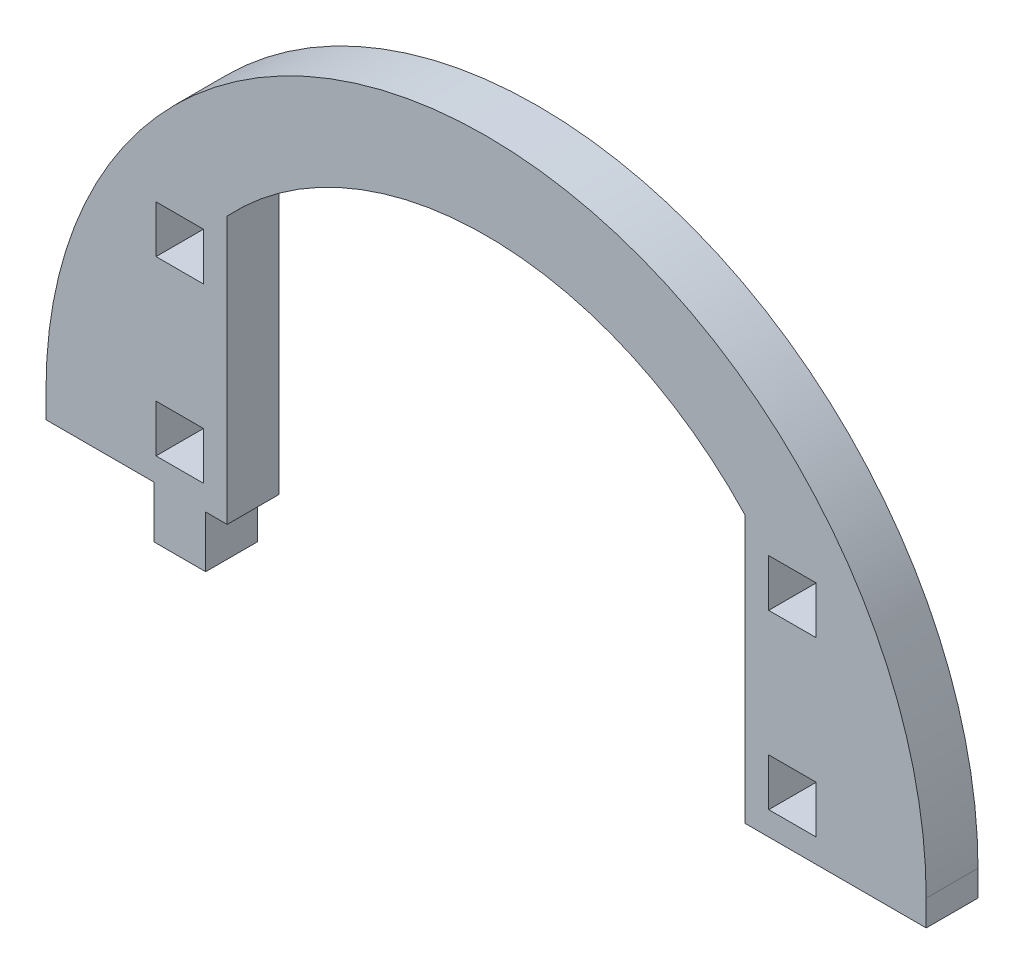
ISO-10303-21;
HEADER;
FILE_DESCRIPTION(('STEP AP214'),'2;1');
FILE_NAME('part.step','',(''),(''),'','','');
FILE_SCHEMA(('AUTOMOTIVE_DESIGN { 1 0 10303 214 1 1 1 1 }'));
ENDSEC;
DATA;
#1=APPLICATION_CONTEXT('core data for automotive mechanical design processes');
#2=APPLICATION_PROTOCOL_DEFINITION('international standard','automotive_design',2000,#1);
#3=PRODUCT_CONTEXT('',#1,'mechanical');
#4=PRODUCT('Part','Part','',(#3));
#5=PRODUCT_RELATED_PRODUCT_CATEGORY('part','',(#4));
#6=PRODUCT_DEFINITION_FORMATION('','',#4);
#7=PRODUCT_DEFINITION_CONTEXT('part definition',#1,'design');
#8=PRODUCT_DEFINITION('design','',#6,#7);
#9=PRODUCT_DEFINITION_SHAPE('','',#8);
#10=(LENGTH_UNIT() NAMED_UNIT(*) SI_UNIT(.MILLI.,.METRE.));
#11=(NAMED_UNIT(*) PLANE_ANGLE_UNIT() SI_UNIT($,.RADIAN.));
#12=(NAMED_UNIT(*) SI_UNIT($,.STERADIAN.) SOLID_ANGLE_UNIT());
#13=UNCERTAINTY_MEASURE_WITH_UNIT(LENGTH_MEASURE(1.E-05),#10,'distance_accuracy_value','');
#14=(GEOMETRIC_REPRESENTATION_CONTEXT(3) GLOBAL_UNCERTAINTY_ASSIGNED_CONTEXT((#13)) GLOBAL_UNIT_ASSIGNED_CONTEXT((#10,
#11,#12)) REPRESENTATION_CONTEXT('',''));
#15=CARTESIAN_POINT('',(0.,0.,0.));
#16=DIRECTION('',(0.,0.,1.));
#17=DIRECTION('',(1.,0.,0.));
#18=AXIS2_PLACEMENT_3D('',#15,#16,#17);
#19=CARTESIAN_POINT('',(3372.52554058257,1259.87734969929,6.));
#20=DIRECTION('',(0.,0.,1.));
#21=DIRECTION('',(1.,0.,0.));
#22=AXIS2_PLACEMENT_3D('',#19,#20,#21);
#23=PLANE('',#22);
#24=DIRECTION('',(0.,-1.,0.));
#25=VECTOR('',#24,1.);
#26=CARTESIAN_POINT('',(3423.52554058257,1259.87734969929,6.));
#27=LINE('',#26,#25);
#28=CARTESIAN_POINT('',(3423.52554058257,1259.87734969929,6.));
#29=VERTEX_POINT('',#28);
#30=CARTESIAN_POINT('',(3423.52554058257,1256.87734969929,6.));
#31=VERTEX_POINT('',#30);
#32=EDGE_CURVE('E607',#29,#31,#27,.T.);
#33=ORIENTED_EDGE('',*,*,#32,.F.);
#34=CARTESIAN_POINT('',(3372.52554058257,1259.87734969929,6.));
#35=DIRECTION('',(0.,0.,1.));
#36=DIRECTION('',(1.,0.,0.));
#37=AXIS2_PLACEMENT_3D('',#34,#35,#36);
#38=CIRCLE('',#37,50.9999999999999);
#39=CARTESIAN_POINT('',(3321.52554058257,1259.87734969929,6.));
#40=VERTEX_POINT('',#39);
#41=EDGE_CURVE('E645',#29,#40,#38,.T.);
#42=ORIENTED_EDGE('',*,*,#41,.T.);
#43=DIRECTION('',(0.,-1.,0.));
#44=VECTOR('',#43,1.);
#45=CARTESIAN_POINT('',(3321.52554058257,1259.87734969929,6.));
#46=LINE('',#45,#44);
#47=CARTESIAN_POINT('',(3321.52554058257,1256.87734969929,6.));
#48=VERTEX_POINT('',#47);
#49=EDGE_CURVE('E642',#40,#48,#46,.T.);
#50=ORIENTED_EDGE('',*,*,#49,.T.);
#51=DIRECTION('',(1.,0.,0.));
#52=VECTOR('',#51,1.);
#53=CARTESIAN_POINT('',(3321.52554058257,1256.87734969929,6.));
#54=LINE('',#53,#52);
#55=CARTESIAN_POINT('',(3334.02554058257,1256.87734969929,6.));
#56=VERTEX_POINT('',#55);
#57=EDGE_CURVE('E639',#48,#56,#54,.T.);
#58=ORIENTED_EDGE('',*,*,#57,.T.);
#59=DIRECTION('',(0.,-1.,0.));
#60=VECTOR('',#59,1.);
#61=CARTESIAN_POINT('',(3334.02554058257,1256.87734969929,6.));
#62=LINE('',#61,#60);
#63=CARTESIAN_POINT('',(3334.02554058257,1250.87734969929,6.));
#64=VERTEX_POINT('',#63);
#65=EDGE_CURVE('E636',#56,#64,#62,.T.);
#66=ORIENTED_EDGE('',*,*,#65,.T.);
#67=DIRECTION('',(1.,0.,0.));
#68=VECTOR('',#67,1.);
#69=CARTESIAN_POINT('',(3334.02554058257,1250.87734969929,6.));
#70=LINE('',#69,#68);
#71=CARTESIAN_POINT('',(3340.02554058257,1250.87734969929,6.));
#72=VERTEX_POINT('',#71);
#73=EDGE_CURVE('E633',#64,#72,#70,.T.);
#74=ORIENTED_EDGE('',*,*,#73,.T.);
#75=DIRECTION('',(0.,1.,0.));
#76=VECTOR('',#75,1.);
#77=CARTESIAN_POINT('',(3340.02554058257,1250.87734969929,6.));
#78=LINE('',#77,#76);
#79=CARTESIAN_POINT('',(3340.02554058257,1256.87734969929,6.));
#80=VERTEX_POINT('',#79);
#81=EDGE_CURVE('E630',#72,#80,#78,.T.);
#82=ORIENTED_EDGE('',*,*,#81,.T.);
#83=DIRECTION('',(1.,0.,0.));
#84=VECTOR('',#83,1.);
#85=CARTESIAN_POINT('',(3340.02554058257,1256.87734969929,6.));
#86=LINE('',#85,#84);
#87=CARTESIAN_POINT('',(3342.52554058257,1256.87734969929,6.));
#88=VERTEX_POINT('',#87);
#89=EDGE_CURVE('E627',#80,#88,#86,.T.);
#90=ORIENTED_EDGE('',*,*,#89,.T.);
#91=DIRECTION('',(0.,-1.,0.));
#92=VECTOR('',#91,1.);
#93=CARTESIAN_POINT('',(3342.52554058257,1287.82372692425,6.));
#94=LINE('',#93,#92);
#95=CARTESIAN_POINT('',(3342.52554058257,1287.82372692425,6.));
#96=VERTEX_POINT('',#95);
#97=EDGE_CURVE('E623',#96,#88,#94,.T.);
#98=ORIENTED_EDGE('',*,*,#97,.F.);
#99=CARTESIAN_POINT('',(3372.52554058257,1259.87734969929,6.));
#100=DIRECTION('',(0.,0.,1.));
#101=DIRECTION('',(1.,0.,0.));
#102=AXIS2_PLACEMENT_3D('',#99,#100,#101);
#103=CIRCLE('',#102,41.);
#104=CARTESIAN_POINT('',(3402.52554058257,1287.82372692425,6.));
#105=VERTEX_POINT('',#104);
#106=EDGE_CURVE('E619',#105,#96,#103,.T.);
#107=ORIENTED_EDGE('',*,*,#106,.F.);
#108=DIRECTION('',(0.,-1.,0.));
#109=VECTOR('',#108,1.);
#110=CARTESIAN_POINT('',(3402.52554058257,1287.82372692425,6.));
#111=LINE('',#110,#109);
#112=CARTESIAN_POINT('',(3402.52554058257,1256.87734969929,6.));
#113=VERTEX_POINT('',#112);
#114=EDGE_CURVE('E615',#105,#113,#111,.T.);
#115=ORIENTED_EDGE('',*,*,#114,.T.);
#116=DIRECTION('',(1.,0.,0.));
#117=VECTOR('',#116,1.);
#118=CARTESIAN_POINT('',(3413.52554058257,1256.87734969929,6.));
#119=LINE('',#118,#117);
#120=EDGE_CURVE('E611',#113,#31,#119,.T.);
#121=ORIENTED_EDGE('',*,*,#120,.T.);
#122=EDGE_LOOP('',(#33,#42,#50,#58,#66,#74,#82,#90,#98,#107,#115,#121));
#123=FACE_BOUND('',#122,.T.);
#124=DIRECTION('',(0.,1.,0.));
#125=VECTOR('',#124,1.);
#126=CARTESIAN_POINT('',(3339.77554058257,0.,6.));
#127=LINE('',#126,#125);
#128=CARTESIAN_POINT('',(3339.77554058257,1279.62734969929,6.));
#129=VERTEX_POINT('',#128);
#130=CARTESIAN_POINT('',(3339.77554058257,1285.12734969929,6.));
#131=VERTEX_POINT('',#130);
#132=EDGE_CURVE('E567',#129,#131,#127,.T.);
#133=ORIENTED_EDGE('',*,*,#132,.F.);
#134=DIRECTION('',(1.,0.,0.));
#135=VECTOR('',#134,1.);
#136=CARTESIAN_POINT('',(0.,1279.62734969929,6.));
#137=LINE('',#136,#135);
#138=CARTESIAN_POINT('',(3334.27554058257,1279.62734969929,6.));
#139=VERTEX_POINT('',#138);
#140=EDGE_CURVE('E564',#139,#129,#137,.T.);
#141=ORIENTED_EDGE('',*,*,#140,.F.);
#142=DIRECTION('',(0.,-1.,0.));
#143=VECTOR('',#142,1.);
#144=CARTESIAN_POINT('',(3334.27554058257,0.,6.));
#145=LINE('',#144,#143);
#146=CARTESIAN_POINT('',(3334.27554058257,1285.12734969929,6.));
#147=VERTEX_POINT('',#146);
#148=EDGE_CURVE('E575',#147,#139,#145,.T.);
#149=ORIENTED_EDGE('',*,*,#148,.F.);
#150=DIRECTION('',(-1.,0.,0.));
#151=VECTOR('',#150,1.);
#152=CARTESIAN_POINT('',(0.,1285.12734969929,6.));
#153=LINE('',#152,#151);
#154=EDGE_CURVE('E571',#131,#147,#153,.T.);
#155=ORIENTED_EDGE('',*,*,#154,.F.);
#156=EDGE_LOOP('',(#133,#141,#149,#155));
#157=FACE_BOUND('',#156,.T.);
#158=DIRECTION('',(0.,1.,0.));
#159=VECTOR('',#158,1.);
#160=CARTESIAN_POINT('',(3339.77554058257,0.,6.));
#161=LINE('',#160,#159);
#162=CARTESIAN_POINT('',(3339.77554058257,1259.62734969929,6.));
#163=VERTEX_POINT('',#162);
#164=CARTESIAN_POINT('',(3339.77554058257,1265.12734969929,6.));
#165=VERTEX_POINT('',#164);
#166=EDGE_CURVE('E524',#163,#165,#161,.T.);
#167=ORIENTED_EDGE('',*,*,#166,.F.);
#168=DIRECTION('',(1.,0.,0.));
#169=VECTOR('',#168,1.);
#170=CARTESIAN_POINT('',(0.,1259.62734969929,6.));
#171=LINE('',#170,#169);
#172=CARTESIAN_POINT('',(3334.27554058257,1259.62734969929,6.));
#173=VERTEX_POINT('',#172);
#174=EDGE_CURVE('E521',#173,#163,#171,.T.);
#175=ORIENTED_EDGE('',*,*,#174,.F.);
#176=DIRECTION('',(0.,-1.,0.));
#177=VECTOR('',#176,1.);
#178=CARTESIAN_POINT('',(3334.27554058257,0.,6.));
#179=LINE('',#178,#177);
#180=CARTESIAN_POINT('',(3334.27554058257,1265.12734969929,6.));
#181=VERTEX_POINT('',#180);
#182=EDGE_CURVE('E532',#181,#173,#179,.T.);
#183=ORIENTED_EDGE('',*,*,#182,.F.);
#184=DIRECTION('',(-1.,0.,0.));
#185=VECTOR('',#184,1.);
#186=CARTESIAN_POINT('',(0.,1265.12734969929,6.));
#187=LINE('',#186,#185);
#188=EDGE_CURVE('E528',#165,#181,#187,.T.);
#189=ORIENTED_EDGE('',*,*,#188,.F.);
#190=EDGE_LOOP('',(#167,#175,#183,#189));
#191=FACE_BOUND('',#190,.T.);
#192=DIRECTION('',(0.,1.,0.));
#193=VECTOR('',#192,1.);
#194=CARTESIAN_POINT('',(3410.77554058257,0.,6.));
#195=LINE('',#194,#193);
#196=CARTESIAN_POINT('',(3410.77554058257,1279.62734969929,6.));
#197=VERTEX_POINT('',#196);
#198=CARTESIAN_POINT('',(3410.77554058257,1285.12734969929,6.));
#199=VERTEX_POINT('',#198);
#200=EDGE_CURVE('E481',#197,#199,#195,.T.);
#201=ORIENTED_EDGE('',*,*,#200,.F.);
#202=DIRECTION('',(1.,0.,0.));
#203=VECTOR('',#202,1.);
#204=CARTESIAN_POINT('',(0.,1279.62734969929,6.));
#205=LINE('',#204,#203);
#206=CARTESIAN_POINT('',(3405.27554058257,1279.62734969929,6.));
#207=VERTEX_POINT('',#206);
#208=EDGE_CURVE('E478',#207,#197,#205,.T.);
#209=ORIENTED_EDGE('',*,*,#208,.F.);
#210=DIRECTION('',(0.,-1.,0.));
#211=VECTOR('',#210,1.);
#212=CARTESIAN_POINT('',(3405.27554058257,0.,6.));
#213=LINE('',#212,#211);
#214=CARTESIAN_POINT('',(3405.27554058257,1285.12734969929,6.));
#215=VERTEX_POINT('',#214);
#216=EDGE_CURVE('E489',#215,#207,#213,.T.);
#217=ORIENTED_EDGE('',*,*,#216,.F.);
#218=DIRECTION('',(-1.,0.,0.));
#219=VECTOR('',#218,1.);
#220=CARTESIAN_POINT('',(0.,1285.12734969929,6.));
#221=LINE('',#220,#219);
#222=EDGE_CURVE('E485',#199,#215,#221,.T.);
#223=ORIENTED_EDGE('',*,*,#222,.F.);
#224=EDGE_LOOP('',(#201,#209,#217,#223));
#225=FACE_BOUND('',#224,.T.);
#226=DIRECTION('',(0.,1.,0.));
#227=VECTOR('',#226,1.);
#228=CARTESIAN_POINT('',(3410.77554058257,0.,6.));
#229=LINE('',#228,#227);
#230=CARTESIAN_POINT('',(3410.77554058257,1259.62734969929,6.));
#231=VERTEX_POINT('',#230);
#232=CARTESIAN_POINT('',(3410.77554058257,1265.12734969929,6.));
#233=VERTEX_POINT('',#232);
#234=EDGE_CURVE('E439',#231,#233,#229,.T.);
#235=ORIENTED_EDGE('',*,*,#234,.F.);
#236=DIRECTION('',(1.,0.,0.));
#237=VECTOR('',#236,1.);
#238=CARTESIAN_POINT('',(0.,1259.62734969929,6.));
#239=LINE('',#238,#237);
#240=CARTESIAN_POINT('',(3405.27554058257,1259.62734969929,6.));
#241=VERTEX_POINT('',#240);
#242=EDGE_CURVE('E430',#241,#231,#239,.T.);
#243=ORIENTED_EDGE('',*,*,#242,.F.);
#244=DIRECTION('',(0.,-1.,0.));
#245=VECTOR('',#244,1.);
#246=CARTESIAN_POINT('',(3405.27554058257,0.,6.));
#247=LINE('',#246,#245);
#248=CARTESIAN_POINT('',(3405.27554058257,1265.12734969929,6.));
#249=VERTEX_POINT('',#248);
#250=EDGE_CURVE('E456',#249,#241,#247,.T.);
#251=ORIENTED_EDGE('',*,*,#250,.F.);
#252=DIRECTION('',(-1.,0.,0.));
#253=VECTOR('',#252,1.);
#254=CARTESIAN_POINT('',(0.,1265.12734969929,6.));
#255=LINE('',#254,#253);
#256=EDGE_CURVE('E452',#233,#249,#255,.T.);
#257=ORIENTED_EDGE('',*,*,#256,.F.);
#258=EDGE_LOOP('',(#235,#243,#251,#257));
#259=FACE_BOUND('',#258,.T.);
#260=ADVANCED_FACE('F243',(#123,#157,#191,#225,#259),#23,.T.);
#261=CARTESIAN_POINT('',(3372.52554058257,1259.87734969929,0.));
#262=DIRECTION('',(0.,0.,1.));
#263=DIRECTION('',(1.,0.,0.));
#264=AXIS2_PLACEMENT_3D('',#261,#262,#263);
#265=PLANE('',#264);
#266=DIRECTION('',(1.,0.,0.));
#267=VECTOR('',#266,1.);
#268=CARTESIAN_POINT('',(0.,1279.62734969929,0.));
#269=LINE('',#268,#267);
#270=CARTESIAN_POINT('',(3405.27554058257,1279.62734969929,0.));
#271=VERTEX_POINT('',#270);
#272=CARTESIAN_POINT('',(3410.77554058257,1279.62734969929,0.));
#273=VERTEX_POINT('',#272);
#274=EDGE_CURVE('E448',#271,#273,#269,.T.);
#275=ORIENTED_EDGE('',*,*,#274,.T.);
#276=DIRECTION('',(0.,1.,0.));
#277=VECTOR('',#276,1.);
#278=CARTESIAN_POINT('',(3410.77554058257,0.,0.));
#279=LINE('',#278,#277);
#280=CARTESIAN_POINT('',(3410.77554058257,1285.12734969929,0.));
#281=VERTEX_POINT('',#280);
#282=EDGE_CURVE('E496',#273,#281,#279,.T.);
#283=ORIENTED_EDGE('',*,*,#282,.T.);
#284=DIRECTION('',(-1.,0.,0.));
#285=VECTOR('',#284,1.);
#286=CARTESIAN_POINT('',(0.,1285.12734969929,0.));
#287=LINE('',#286,#285);
#288=CARTESIAN_POINT('',(3405.27554058257,1285.12734969929,0.));
#289=VERTEX_POINT('',#288);
#290=EDGE_CURVE('E500',#281,#289,#287,.T.);
#291=ORIENTED_EDGE('',*,*,#290,.T.);
#292=DIRECTION('',(0.,-1.,0.));
#293=VECTOR('',#292,1.);
#294=CARTESIAN_POINT('',(3405.27554058257,0.,0.));
#295=LINE('',#294,#293);
#296=EDGE_CURVE('E482',#289,#271,#295,.T.);
#297=ORIENTED_EDGE('',*,*,#296,.T.);
#298=EDGE_LOOP('',(#275,#283,#291,#297));
#299=FACE_BOUND('',#298,.T.);
#300=DIRECTION('',(1.,0.,0.));
#301=VECTOR('',#300,1.);
#302=CARTESIAN_POINT('',(0.,1279.62734969929,0.));
#303=LINE('',#302,#301);
#304=CARTESIAN_POINT('',(3334.27554058257,1279.62734969929,0.));
#305=VERTEX_POINT('',#304);
#306=CARTESIAN_POINT('',(3339.77554058257,1279.62734969929,0.));
#307=VERTEX_POINT('',#306);
#308=EDGE_CURVE('E563',#305,#307,#303,.T.);
#309=ORIENTED_EDGE('',*,*,#308,.T.);
#310=DIRECTION('',(0.,1.,0.));
#311=VECTOR('',#310,1.);
#312=CARTESIAN_POINT('',(3339.77554058257,0.,0.));
#313=LINE('',#312,#311);
#314=CARTESIAN_POINT('',(3339.77554058257,1285.12734969929,0.));
#315=VERTEX_POINT('',#314);
#316=EDGE_CURVE('E582',#307,#315,#313,.T.);
#317=ORIENTED_EDGE('',*,*,#316,.T.);
#318=DIRECTION('',(-1.,0.,0.));
#319=VECTOR('',#318,1.);
#320=CARTESIAN_POINT('',(0.,1285.12734969929,0.));
#321=LINE('',#320,#319);
#322=CARTESIAN_POINT('',(3334.27554058257,1285.12734969929,0.));
#323=VERTEX_POINT('',#322);
#324=EDGE_CURVE('E586',#315,#323,#321,.T.);
#325=ORIENTED_EDGE('',*,*,#324,.T.);
#326=DIRECTION('',(0.,-1.,0.));
#327=VECTOR('',#326,1.);
#328=CARTESIAN_POINT('',(3334.27554058257,0.,0.));
#329=LINE('',#328,#327);
#330=EDGE_CURVE('E568',#323,#305,#329,.T.);
#331=ORIENTED_EDGE('',*,*,#330,.T.);
#332=EDGE_LOOP('',(#309,#317,#325,#331));
#333=FACE_BOUND('',#332,.T.);
#334=DIRECTION('',(0.,-1.,0.));
#335=VECTOR('',#334,1.);
#336=CARTESIAN_POINT('',(3423.52554058257,1259.87734969929,0.));
#337=LINE('',#336,#335);
#338=CARTESIAN_POINT('',(3423.52554058257,1259.87734969929,0.));
#339=VERTEX_POINT('',#338);
#340=CARTESIAN_POINT('',(3423.52554058257,1256.87734969929,0.));
#341=VERTEX_POINT('',#340);
#342=EDGE_CURVE('E606',#339,#341,#337,.T.);
#343=ORIENTED_EDGE('',*,*,#342,.T.);
#344=DIRECTION('',(1.,0.,0.));
#345=VECTOR('',#344,1.);
#346=CARTESIAN_POINT('',(3402.52554058257,1256.87734969929,0.));
#347=LINE('',#346,#345);
#348=CARTESIAN_POINT('',(3402.52554058257,1256.87734969929,0.));
#349=VERTEX_POINT('',#348);
#350=EDGE_CURVE('E651',#349,#341,#347,.T.);
#351=ORIENTED_EDGE('',*,*,#350,.F.);
#352=DIRECTION('',(0.,-1.,0.));
#353=VECTOR('',#352,1.);
#354=CARTESIAN_POINT('',(3402.52554058257,1287.82372692425,0.));
#355=LINE('',#354,#353);
#356=CARTESIAN_POINT('',(3402.52554058257,1287.82372692425,0.));
#357=VERTEX_POINT('',#356);
#358=EDGE_CURVE('E654',#357,#349,#355,.T.);
#359=ORIENTED_EDGE('',*,*,#358,.F.);
#360=CARTESIAN_POINT('',(3372.52554058257,1259.87734969929,0.));
#361=DIRECTION('',(0.,0.,1.));
#362=DIRECTION('',(1.,0.,0.));
#363=AXIS2_PLACEMENT_3D('',#360,#361,#362);
#364=CIRCLE('',#363,41.);
#365=CARTESIAN_POINT('',(3342.52554058257,1287.82372692425,0.));
#366=VERTEX_POINT('',#365);
#367=EDGE_CURVE('E657',#357,#366,#364,.T.);
#368=ORIENTED_EDGE('',*,*,#367,.T.);
#369=DIRECTION('',(0.,-1.,0.));
#370=VECTOR('',#369,1.);
#371=CARTESIAN_POINT('',(3342.52554058257,1287.82372692425,0.));
#372=LINE('',#371,#370);
#373=CARTESIAN_POINT('',(3342.52554058257,1256.87734969929,0.));
#374=VERTEX_POINT('',#373);
#375=EDGE_CURVE('E661',#366,#374,#372,.T.);
#376=ORIENTED_EDGE('',*,*,#375,.T.);
#377=DIRECTION('',(1.,0.,0.));
#378=VECTOR('',#377,1.);
#379=CARTESIAN_POINT('',(3340.02554058257,1256.87734969929,0.));
#380=LINE('',#379,#378);
#381=CARTESIAN_POINT('',(3340.02554058257,1256.87734969929,0.));
#382=VERTEX_POINT('',#381);
#383=EDGE_CURVE('E665',#382,#374,#380,.T.);
#384=ORIENTED_EDGE('',*,*,#383,.F.);
#385=DIRECTION('',(0.,1.,0.));
#386=VECTOR('',#385,1.);
#387=CARTESIAN_POINT('',(3340.02554058257,1250.87734969929,0.));
#388=LINE('',#387,#386);
#389=CARTESIAN_POINT('',(3340.02554058257,1250.87734969929,0.));
#390=VERTEX_POINT('',#389);
#391=EDGE_CURVE('E669',#390,#382,#388,.T.);
#392=ORIENTED_EDGE('',*,*,#391,.F.);
#393=DIRECTION('',(1.,0.,0.));
#394=VECTOR('',#393,1.);
#395=CARTESIAN_POINT('',(3334.02554058257,1250.87734969929,0.));
#396=LINE('',#395,#394);
#397=CARTESIAN_POINT('',(3334.02554058257,1250.87734969929,0.));
#398=VERTEX_POINT('',#397);
#399=EDGE_CURVE('E672',#398,#390,#396,.T.);
#400=ORIENTED_EDGE('',*,*,#399,.F.);
#401=DIRECTION('',(0.,-1.,0.));
#402=VECTOR('',#401,1.);
#403=CARTESIAN_POINT('',(3334.02554058257,1256.87734969929,0.));
#404=LINE('',#403,#402);
#405=CARTESIAN_POINT('',(3334.02554058257,1256.87734969929,0.));
#406=VERTEX_POINT('',#405);
#407=EDGE_CURVE('E675',#406,#398,#404,.T.);
#408=ORIENTED_EDGE('',*,*,#407,.F.);
#409=DIRECTION('',(1.,0.,0.));
#410=VECTOR('',#409,1.);
#411=CARTESIAN_POINT('',(3321.52554058257,1256.87734969929,0.));
#412=LINE('',#411,#410);
#413=CARTESIAN_POINT('',(3321.52554058257,1256.87734969929,0.));
#414=VERTEX_POINT('',#413);
#415=EDGE_CURVE('E678',#414,#406,#412,.T.);
#416=ORIENTED_EDGE('',*,*,#415,.F.);
#417=DIRECTION('',(0.,-1.,0.));
#418=VECTOR('',#417,1.);
#419=CARTESIAN_POINT('',(3321.52554058257,1259.87734969929,0.));
#420=LINE('',#419,#418);
#421=CARTESIAN_POINT('',(3321.52554058257,1259.87734969929,0.));
#422=VERTEX_POINT('',#421);
#423=EDGE_CURVE('E681',#422,#414,#420,.T.);
#424=ORIENTED_EDGE('',*,*,#423,.F.);
#425=CARTESIAN_POINT('',(3372.52554058257,1259.87734969929,0.));
#426=DIRECTION('',(0.,0.,1.));
#427=DIRECTION('',(1.,0.,0.));
#428=AXIS2_PLACEMENT_3D('',#425,#426,#427);
#429=CIRCLE('',#428,50.9999999999999);
#430=EDGE_CURVE('E612',#339,#422,#429,.T.);
#431=ORIENTED_EDGE('',*,*,#430,.F.);
#432=EDGE_LOOP('',(#343,#351,#359,#368,#376,#384,#392,#400,#408,#416,#424,#431));
#433=FACE_BOUND('',#432,.T.);
#434=DIRECTION('',(1.,0.,0.));
#435=VECTOR('',#434,1.);
#436=CARTESIAN_POINT('',(0.,1259.62734969929,0.));
#437=LINE('',#436,#435);
#438=CARTESIAN_POINT('',(3334.27554058257,1259.62734969929,0.));
#439=VERTEX_POINT('',#438);
#440=CARTESIAN_POINT('',(3339.77554058257,1259.62734969929,0.));
#441=VERTEX_POINT('',#440);
#442=EDGE_CURVE('E520',#439,#441,#437,.T.);
#443=ORIENTED_EDGE('',*,*,#442,.T.);
#444=DIRECTION('',(0.,1.,0.));
#445=VECTOR('',#444,1.);
#446=CARTESIAN_POINT('',(3339.77554058257,0.,0.));
#447=LINE('',#446,#445);
#448=CARTESIAN_POINT('',(3339.77554058257,1265.12734969929,0.));
#449=VERTEX_POINT('',#448);
#450=EDGE_CURVE('E539',#441,#449,#447,.T.);
#451=ORIENTED_EDGE('',*,*,#450,.T.);
#452=DIRECTION('',(-1.,0.,0.));
#453=VECTOR('',#452,1.);
#454=CARTESIAN_POINT('',(0.,1265.12734969929,0.));
#455=LINE('',#454,#453);
#456=CARTESIAN_POINT('',(3334.27554058257,1265.12734969929,0.));
#457=VERTEX_POINT('',#456);
#458=EDGE_CURVE('E543',#449,#457,#455,.T.);
#459=ORIENTED_EDGE('',*,*,#458,.T.);
#460=DIRECTION('',(0.,-1.,0.));
#461=VECTOR('',#460,1.);
#462=CARTESIAN_POINT('',(3334.27554058257,0.,0.));
#463=LINE('',#462,#461);
#464=EDGE_CURVE('E525',#457,#439,#463,.T.);
#465=ORIENTED_EDGE('',*,*,#464,.T.);
#466=EDGE_LOOP('',(#443,#451,#459,#465));
#467=FACE_BOUND('',#466,.T.);
#468=DIRECTION('',(1.,0.,0.));
#469=VECTOR('',#468,1.);
#470=CARTESIAN_POINT('',(0.,1259.62734969929,0.));
#471=LINE('',#470,#469);
#472=CARTESIAN_POINT('',(3405.27554058257,1259.62734969929,0.));
#473=VERTEX_POINT('',#472);
#474=CARTESIAN_POINT('',(3410.77554058257,1259.62734969929,0.));
#475=VERTEX_POINT('',#474);
#476=EDGE_CURVE('E269',#473,#475,#471,.T.);
#477=ORIENTED_EDGE('',*,*,#476,.T.);
#478=DIRECTION('',(0.,1.,0.));
#479=VECTOR('',#478,1.);
#480=CARTESIAN_POINT('',(3410.77554058257,0.,0.));
#481=LINE('',#480,#479);
#482=CARTESIAN_POINT('',(3410.77554058257,1265.12734969929,0.));
#483=VERTEX_POINT('',#482);
#484=EDGE_CURVE('E446',#475,#483,#481,.T.);
#485=ORIENTED_EDGE('',*,*,#484,.T.);
#486=DIRECTION('',(-1.,0.,0.));
#487=VECTOR('',#486,1.);
#488=CARTESIAN_POINT('',(0.,1265.12734969929,0.));
#489=LINE('',#488,#487);
#490=CARTESIAN_POINT('',(3405.27554058257,1265.12734969929,0.));
#491=VERTEX_POINT('',#490);
#492=EDGE_CURVE('E465',#483,#491,#489,.T.);
#493=ORIENTED_EDGE('',*,*,#492,.T.);
#494=DIRECTION('',(0.,-1.,0.));
#495=VECTOR('',#494,1.);
#496=CARTESIAN_POINT('',(3405.27554058257,0.,0.));
#497=LINE('',#496,#495);
#498=EDGE_CURVE('E440',#491,#473,#497,.T.);
#499=ORIENTED_EDGE('',*,*,#498,.T.);
#500=EDGE_LOOP('',(#477,#485,#493,#499));
#501=FACE_BOUND('',#500,.T.);
#502=ADVANCED_FACE('F731',(#299,#333,#433,#467,#501),#265,.F.);
#503=CARTESIAN_POINT('',(3423.52554058257,1259.87734969929,6.));
#504=DIRECTION('',(1.,0.,0.));
#505=DIRECTION('',(0.,0.,-1.));
#506=AXIS2_PLACEMENT_3D('',#503,#504,#505);
#507=PLANE('',#506);
#508=ORIENTED_EDGE('',*,*,#342,.F.);
#509=DIRECTION('',(0.,0.,-1.));
#510=VECTOR('',#509,1.);
#511=CARTESIAN_POINT('',(3423.52554058257,1259.87734969929,6.));
#512=LINE('',#511,#510);
#513=EDGE_CURVE('E12',#29,#339,#512,.T.);
#514=ORIENTED_EDGE('',*,*,#513,.F.);
#515=ORIENTED_EDGE('',*,*,#32,.T.);
#516=DIRECTION('',(0.,0.,-1.));
#517=VECTOR('',#516,1.);
#518=CARTESIAN_POINT('',(3423.52554058257,1256.87734969929,6.));
#519=LINE('',#518,#517);
#520=EDGE_CURVE('E247',#31,#341,#519,.T.);
#521=ORIENTED_EDGE('',*,*,#520,.T.);
#522=EDGE_LOOP('',(#508,#514,#515,#521));
#523=FACE_BOUND('',#522,.T.);
#524=ADVANCED_FACE('F245',(#523),#507,.T.);
#525=CARTESIAN_POINT('',(3372.52554058257,1259.87734969929,6.));
#526=DIRECTION('',(0.,0.,-1.));
#527=DIRECTION('',(-1.,0.,0.));
#528=AXIS2_PLACEMENT_3D('',#525,#526,#527);
#529=CYLINDRICAL_SURFACE('',#528,50.9999999999999);
#530=ORIENTED_EDGE('',*,*,#430,.T.);
#531=DIRECTION('',(0.,0.,-1.));
#532=VECTOR('',#531,1.);
#533=CARTESIAN_POINT('',(3321.52554058257,1259.87734969929,6.));
#534=LINE('',#533,#532);
#535=EDGE_CURVE('E253',#40,#422,#534,.T.);
#536=ORIENTED_EDGE('',*,*,#535,.F.);
#537=ORIENTED_EDGE('',*,*,#41,.F.);
#538=ORIENTED_EDGE('',*,*,#513,.T.);
#539=EDGE_LOOP('',(#530,#536,#537,#538));
#540=FACE_BOUND('',#539,.T.);
#541=ADVANCED_FACE('F738',(#540),#529,.T.);
#542=CARTESIAN_POINT('',(3321.52554058257,1259.87734969929,6.));
#543=DIRECTION('',(1.,0.,0.));
#544=DIRECTION('',(0.,0.,-1.));
#545=AXIS2_PLACEMENT_3D('',#542,#543,#544);
#546=PLANE('',#545);
#547=ORIENTED_EDGE('',*,*,#423,.T.);
#548=DIRECTION('',(0.,0.,-1.));
#549=VECTOR('',#548,1.);
#550=CARTESIAN_POINT('',(3321.52554058257,1256.87734969929,6.));
#551=LINE('',#550,#549);
#552=EDGE_CURVE('E689',#48,#414,#551,.T.);
#553=ORIENTED_EDGE('',*,*,#552,.F.);
#554=ORIENTED_EDGE('',*,*,#49,.F.);
#555=ORIENTED_EDGE('',*,*,#535,.T.);
#556=EDGE_LOOP('',(#547,#553,#554,#555));
#557=FACE_BOUND('',#556,.T.);
#558=ADVANCED_FACE('F742',(#557),#546,.F.);
#559=CARTESIAN_POINT('',(3321.52554058257,1256.87734969929,6.));
#560=DIRECTION('',(0.,1.,0.));
#561=DIRECTION('',(0.,0.,1.));
#562=AXIS2_PLACEMENT_3D('',#559,#560,#561);
#563=PLANE('',#562);
#564=ORIENTED_EDGE('',*,*,#415,.T.);
#565=DIRECTION('',(0.,0.,-1.));
#566=VECTOR('',#565,1.);
#567=CARTESIAN_POINT('',(3334.02554058257,1256.87734969929,6.));
#568=LINE('',#567,#566);
#569=EDGE_CURVE('E693',#56,#406,#568,.T.);
#570=ORIENTED_EDGE('',*,*,#569,.F.);
#571=ORIENTED_EDGE('',*,*,#57,.F.);
#572=ORIENTED_EDGE('',*,*,#552,.T.);
#573=EDGE_LOOP('',(#564,#570,#571,#572));
#574=FACE_BOUND('',#573,.T.);
#575=ADVANCED_FACE('F777',(#574),#563,.F.);
#576=CARTESIAN_POINT('',(3334.02554058257,1256.87734969929,6.));
#577=DIRECTION('',(1.,0.,0.));
#578=DIRECTION('',(0.,0.,-1.));
#579=AXIS2_PLACEMENT_3D('',#576,#577,#578);
#580=PLANE('',#579);
#581=ORIENTED_EDGE('',*,*,#407,.T.);
#582=DIRECTION('',(0.,0.,-1.));
#583=VECTOR('',#582,1.);
#584=CARTESIAN_POINT('',(3334.02554058257,1250.87734969929,6.));
#585=LINE('',#584,#583);
#586=EDGE_CURVE('E697',#64,#398,#585,.T.);
#587=ORIENTED_EDGE('',*,*,#586,.F.);
#588=ORIENTED_EDGE('',*,*,#65,.F.);
#589=ORIENTED_EDGE('',*,*,#569,.T.);
#590=EDGE_LOOP('',(#581,#587,#588,#589));
#591=FACE_BOUND('',#590,.T.);
#592=ADVANCED_FACE('F780',(#591),#580,.F.);
#593=CARTESIAN_POINT('',(3334.02554058257,1250.87734969929,6.));
#594=DIRECTION('',(0.,1.,0.));
#595=DIRECTION('',(0.,0.,1.));
#596=AXIS2_PLACEMENT_3D('',#593,#594,#595);
#597=PLANE('',#596);
#598=ORIENTED_EDGE('',*,*,#399,.T.);
#599=DIRECTION('',(0.,0.,-1.));
#600=VECTOR('',#599,1.);
#601=CARTESIAN_POINT('',(3340.02554058257,1250.87734969929,6.));
#602=LINE('',#601,#600);
#603=EDGE_CURVE('E701',#72,#390,#602,.T.);
#604=ORIENTED_EDGE('',*,*,#603,.F.);
#605=ORIENTED_EDGE('',*,*,#73,.F.);
#606=ORIENTED_EDGE('',*,*,#586,.T.);
#607=EDGE_LOOP('',(#598,#604,#605,#606));
#608=FACE_BOUND('',#607,.T.);
#609=ADVANCED_FACE('F784',(#608),#597,.F.);
#610=CARTESIAN_POINT('',(3340.02554058257,1250.87734969929,6.));
#611=DIRECTION('',(-1.,0.,0.));
#612=DIRECTION('',(0.,0.,1.));
#613=AXIS2_PLACEMENT_3D('',#610,#611,#612);
#614=PLANE('',#613);
#615=ORIENTED_EDGE('',*,*,#391,.T.);
#616=DIRECTION('',(0.,0.,-1.));
#617=VECTOR('',#616,1.);
#618=CARTESIAN_POINT('',(3340.02554058257,1256.87734969929,6.));
#619=LINE('',#618,#617);
#620=EDGE_CURVE('E705',#80,#382,#619,.T.);
#621=ORIENTED_EDGE('',*,*,#620,.F.);
#622=ORIENTED_EDGE('',*,*,#81,.F.);
#623=ORIENTED_EDGE('',*,*,#603,.T.);
#624=EDGE_LOOP('',(#615,#621,#622,#623));
#625=FACE_BOUND('',#624,.T.);
#626=ADVANCED_FACE('F788',(#625),#614,.F.);
#627=CARTESIAN_POINT('',(3340.02554058257,1256.87734969929,6.));
#628=DIRECTION('',(0.,1.,0.));
#629=DIRECTION('',(0.,0.,1.));
#630=AXIS2_PLACEMENT_3D('',#627,#628,#629);
#631=PLANE('',#630);
#632=ORIENTED_EDGE('',*,*,#383,.T.);
#633=DIRECTION('',(0.,0.,-1.));
#634=VECTOR('',#633,1.);
#635=CARTESIAN_POINT('',(3342.52554058257,1256.87734969929,6.));
#636=LINE('',#635,#634);
#637=EDGE_CURVE('E709',#88,#374,#636,.T.);
#638=ORIENTED_EDGE('',*,*,#637,.F.);
#639=ORIENTED_EDGE('',*,*,#89,.F.);
#640=ORIENTED_EDGE('',*,*,#620,.T.);
#641=EDGE_LOOP('',(#632,#638,#639,#640));
#642=FACE_BOUND('',#641,.T.);
#643=ADVANCED_FACE('F792',(#642),#631,.F.);
#644=CARTESIAN_POINT('',(3342.52554058257,1287.82372692425,6.));
#645=DIRECTION('',(1.,0.,0.));
#646=DIRECTION('',(0.,0.,-1.));
#647=AXIS2_PLACEMENT_3D('',#644,#645,#646);
#648=PLANE('',#647);
#649=ORIENTED_EDGE('',*,*,#375,.F.);
#650=DIRECTION('',(0.,0.,-1.));
#651=VECTOR('',#650,1.);
#652=CARTESIAN_POINT('',(3342.52554058257,1287.82372692425,6.));
#653=LINE('',#652,#651);
#654=EDGE_CURVE('E712',#96,#366,#653,.T.);
#655=ORIENTED_EDGE('',*,*,#654,.F.);
#656=ORIENTED_EDGE('',*,*,#97,.T.);
#657=ORIENTED_EDGE('',*,*,#637,.T.);
#658=EDGE_LOOP('',(#649,#655,#656,#657));
#659=FACE_BOUND('',#658,.T.);
#660=ADVANCED_FACE('F796',(#659),#648,.T.);
#661=CARTESIAN_POINT('',(3372.52554058257,1259.87734969929,6.));
#662=DIRECTION('',(0.,0.,-1.));
#663=DIRECTION('',(-1.,0.,0.));
#664=AXIS2_PLACEMENT_3D('',#661,#662,#663);
#665=CYLINDRICAL_SURFACE('',#664,41.);
#666=ORIENTED_EDGE('',*,*,#367,.F.);
#667=DIRECTION('',(0.,0.,-1.));
#668=VECTOR('',#667,1.);
#669=CARTESIAN_POINT('',(3402.52554058257,1287.82372692425,6.));
#670=LINE('',#669,#668);
#671=EDGE_CURVE('E715',#105,#357,#670,.T.);
#672=ORIENTED_EDGE('',*,*,#671,.F.);
#673=ORIENTED_EDGE('',*,*,#106,.T.);
#674=ORIENTED_EDGE('',*,*,#654,.T.);
#675=EDGE_LOOP('',(#666,#672,#673,#674));
#676=FACE_BOUND('',#675,.T.);
#677=ADVANCED_FACE('F761',(#676),#665,.F.);
#678=CARTESIAN_POINT('',(3402.52554058257,1287.82372692425,6.));
#679=DIRECTION('',(1.,0.,0.));
#680=DIRECTION('',(0.,0.,-1.));
#681=AXIS2_PLACEMENT_3D('',#678,#679,#680);
#682=PLANE('',#681);
#683=ORIENTED_EDGE('',*,*,#358,.T.);
#684=DIRECTION('',(0.,0.,-1.));
#685=VECTOR('',#684,1.);
#686=CARTESIAN_POINT('',(3402.52554058257,1256.87734969929,6.));
#687=LINE('',#686,#685);
#688=EDGE_CURVE('E717',#113,#349,#687,.T.);
#689=ORIENTED_EDGE('',*,*,#688,.F.);
#690=ORIENTED_EDGE('',*,*,#114,.F.);
#691=ORIENTED_EDGE('',*,*,#671,.T.);
#692=EDGE_LOOP('',(#683,#689,#690,#691));
#693=FACE_BOUND('',#692,.T.);
#694=ADVANCED_FACE('F753',(#693),#682,.F.);
#695=CARTESIAN_POINT('',(3402.52554058257,1256.87734969929,6.));
#696=DIRECTION('',(0.,1.,0.));
#697=DIRECTION('',(0.,0.,1.));
#698=AXIS2_PLACEMENT_3D('',#695,#696,#697);
#699=PLANE('',#698);
#700=ORIENTED_EDGE('',*,*,#350,.T.);
#701=ORIENTED_EDGE('',*,*,#520,.F.);
#702=ORIENTED_EDGE('',*,*,#120,.F.);
#703=ORIENTED_EDGE('',*,*,#688,.T.);
#704=EDGE_LOOP('',(#700,#701,#702,#703));
#705=FACE_BOUND('',#704,.T.);
#706=ADVANCED_FACE('F750',(#705),#699,.F.);
#707=CARTESIAN_POINT('',(0.,1279.62734969929,6.));
#708=DIRECTION('',(0.,1.,0.));
#709=DIRECTION('',(0.,0.,1.));
#710=AXIS2_PLACEMENT_3D('',#707,#708,#709);
#711=PLANE('',#710);
#712=ORIENTED_EDGE('',*,*,#308,.F.);
#713=DIRECTION('',(0.,0.,-1.));
#714=VECTOR('',#713,1.);
#715=CARTESIAN_POINT('',(3334.27554058257,1279.62734969929,6.));
#716=LINE('',#715,#714);
#717=EDGE_CURVE('E578',#139,#305,#716,.T.);
#718=ORIENTED_EDGE('',*,*,#717,.F.);
#719=ORIENTED_EDGE('',*,*,#140,.T.);
#720=DIRECTION('',(0.,0.,-1.));
#721=VECTOR('',#720,1.);
#722=CARTESIAN_POINT('',(3339.77554058257,1279.62734969929,6.));
#723=LINE('',#722,#721);
#724=EDGE_CURVE('E602',#129,#307,#723,.T.);
#725=ORIENTED_EDGE('',*,*,#724,.T.);
#726=EDGE_LOOP('',(#712,#718,#719,#725));
#727=FACE_BOUND('',#726,.T.);
#728=ADVANCED_FACE('F752',(#727),#711,.T.);
#729=CARTESIAN_POINT('',(3339.77554058257,0.,6.));
#730=DIRECTION('',(-1.,0.,0.));
#731=DIRECTION('',(0.,0.,1.));
#732=AXIS2_PLACEMENT_3D('',#729,#730,#731);
#733=PLANE('',#732);
#734=ORIENTED_EDGE('',*,*,#316,.F.);
#735=ORIENTED_EDGE('',*,*,#724,.F.);
#736=ORIENTED_EDGE('',*,*,#132,.T.);
#737=DIRECTION('',(0.,0.,-1.));
#738=VECTOR('',#737,1.);
#739=CARTESIAN_POINT('',(3339.77554058257,1285.12734969929,6.));
#740=LINE('',#739,#738);
#741=EDGE_CURVE('E599',#131,#315,#740,.T.);
#742=ORIENTED_EDGE('',*,*,#741,.T.);
#743=EDGE_LOOP('',(#734,#735,#736,#742));
#744=FACE_BOUND('',#743,.T.);
#745=ADVANCED_FACE('F758',(#744),#733,.T.);
#746=CARTESIAN_POINT('',(0.,1285.12734969929,6.));
#747=DIRECTION('',(0.,-1.,0.));
#748=DIRECTION('',(0.,0.,-1.));
#749=AXIS2_PLACEMENT_3D('',#746,#747,#748);
#750=PLANE('',#749);
#751=ORIENTED_EDGE('',*,*,#324,.F.);
#752=ORIENTED_EDGE('',*,*,#741,.F.);
#753=ORIENTED_EDGE('',*,*,#154,.T.);
#754=DIRECTION('',(0.,0.,-1.));
#755=VECTOR('',#754,1.);
#756=CARTESIAN_POINT('',(3334.27554058257,1285.12734969929,6.));
#757=LINE('',#756,#755);
#758=EDGE_CURVE('E596',#147,#323,#757,.T.);
#759=ORIENTED_EDGE('',*,*,#758,.T.);
#760=EDGE_LOOP('',(#751,#752,#753,#759));
#761=FACE_BOUND('',#760,.T.);
#762=ADVANCED_FACE('F846',(#761),#750,.T.);
#763=CARTESIAN_POINT('',(3334.27554058257,0.,6.));
#764=DIRECTION('',(1.,0.,0.));
#765=DIRECTION('',(0.,0.,-1.));
#766=AXIS2_PLACEMENT_3D('',#763,#764,#765);
#767=PLANE('',#766);
#768=ORIENTED_EDGE('',*,*,#330,.F.);
#769=ORIENTED_EDGE('',*,*,#758,.F.);
#770=ORIENTED_EDGE('',*,*,#148,.T.);
#771=ORIENTED_EDGE('',*,*,#717,.T.);
#772=EDGE_LOOP('',(#768,#769,#770,#771));
#773=FACE_BOUND('',#772,.T.);
#774=ADVANCED_FACE('F855',(#773),#767,.T.);
#775=CARTESIAN_POINT('',(0.,1259.62734969929,6.));
#776=DIRECTION('',(0.,1.,0.));
#777=DIRECTION('',(0.,0.,1.));
#778=AXIS2_PLACEMENT_3D('',#775,#776,#777);
#779=PLANE('',#778);
#780=ORIENTED_EDGE('',*,*,#442,.F.);
#781=DIRECTION('',(0.,0.,-1.));
#782=VECTOR('',#781,1.);
#783=CARTESIAN_POINT('',(3334.27554058257,1259.62734969929,6.));
#784=LINE('',#783,#782);
#785=EDGE_CURVE('E535',#173,#439,#784,.T.);
#786=ORIENTED_EDGE('',*,*,#785,.F.);
#787=ORIENTED_EDGE('',*,*,#174,.T.);
#788=DIRECTION('',(0.,0.,-1.));
#789=VECTOR('',#788,1.);
#790=CARTESIAN_POINT('',(3339.77554058257,1259.62734969929,6.));
#791=LINE('',#790,#789);
#792=EDGE_CURVE('E559',#163,#441,#791,.T.);
#793=ORIENTED_EDGE('',*,*,#792,.T.);
#794=EDGE_LOOP('',(#780,#786,#787,#793));
#795=FACE_BOUND('',#794,.T.);
#796=ADVANCED_FACE('F865',(#795),#779,.T.);
#797=CARTESIAN_POINT('',(3339.77554058257,0.,6.));
#798=DIRECTION('',(-1.,0.,0.));
#799=DIRECTION('',(0.,0.,1.));
#800=AXIS2_PLACEMENT_3D('',#797,#798,#799);
#801=PLANE('',#800);
#802=ORIENTED_EDGE('',*,*,#450,.F.);
#803=ORIENTED_EDGE('',*,*,#792,.F.);
#804=ORIENTED_EDGE('',*,*,#166,.T.);
#805=DIRECTION('',(0.,0.,-1.));
#806=VECTOR('',#805,1.);
#807=CARTESIAN_POINT('',(3339.77554058257,1265.12734969929,6.));
#808=LINE('',#807,#806);
#809=EDGE_CURVE('E556',#165,#449,#808,.T.);
#810=ORIENTED_EDGE('',*,*,#809,.T.);
#811=EDGE_LOOP('',(#802,#803,#804,#810));
#812=FACE_BOUND('',#811,.T.);
#813=ADVANCED_FACE('F875',(#812),#801,.T.);
#814=CARTESIAN_POINT('',(0.,1265.12734969929,6.));
#815=DIRECTION('',(0.,-1.,0.));
#816=DIRECTION('',(0.,0.,-1.));
#817=AXIS2_PLACEMENT_3D('',#814,#815,#816);
#818=PLANE('',#817);
#819=ORIENTED_EDGE('',*,*,#458,.F.);
#820=ORIENTED_EDGE('',*,*,#809,.F.);
#821=ORIENTED_EDGE('',*,*,#188,.T.);
#822=DIRECTION('',(0.,0.,-1.));
#823=VECTOR('',#822,1.);
#824=CARTESIAN_POINT('',(3334.27554058257,1265.12734969929,6.));
#825=LINE('',#824,#823);
#826=EDGE_CURVE('E553',#181,#457,#825,.T.);
#827=ORIENTED_EDGE('',*,*,#826,.T.);
#828=EDGE_LOOP('',(#819,#820,#821,#827));
#829=FACE_BOUND('',#828,.T.);
#830=ADVANCED_FACE('F885',(#829),#818,.T.);
#831=CARTESIAN_POINT('',(3334.27554058257,0.,6.));
#832=DIRECTION('',(1.,0.,0.));
#833=DIRECTION('',(0.,0.,-1.));
#834=AXIS2_PLACEMENT_3D('',#831,#832,#833);
#835=PLANE('',#834);
#836=ORIENTED_EDGE('',*,*,#464,.F.);
#837=ORIENTED_EDGE('',*,*,#826,.F.);
#838=ORIENTED_EDGE('',*,*,#182,.T.);
#839=ORIENTED_EDGE('',*,*,#785,.T.);
#840=EDGE_LOOP('',(#836,#837,#838,#839));
#841=FACE_BOUND('',#840,.T.);
#842=ADVANCED_FACE('F895',(#841),#835,.T.);
#843=CARTESIAN_POINT('',(0.,1279.62734969929,6.));
#844=DIRECTION('',(0.,1.,0.));
#845=DIRECTION('',(0.,0.,1.));
#846=AXIS2_PLACEMENT_3D('',#843,#844,#845);
#847=PLANE('',#846);
#848=ORIENTED_EDGE('',*,*,#274,.F.);
#849=DIRECTION('',(0.,0.,-1.));
#850=VECTOR('',#849,1.);
#851=CARTESIAN_POINT('',(3405.27554058257,1279.62734969929,6.));
#852=LINE('',#851,#850);
#853=EDGE_CURVE('E492',#207,#271,#852,.T.);
#854=ORIENTED_EDGE('',*,*,#853,.F.);
#855=ORIENTED_EDGE('',*,*,#208,.T.);
#856=DIRECTION('',(0.,0.,-1.));
#857=VECTOR('',#856,1.);
#858=CARTESIAN_POINT('',(3410.77554058257,1279.62734969929,6.));
#859=LINE('',#858,#857);
#860=EDGE_CURVE('E516',#197,#273,#859,.T.);
#861=ORIENTED_EDGE('',*,*,#860,.T.);
#862=EDGE_LOOP('',(#848,#854,#855,#861));
#863=FACE_BOUND('',#862,.T.);
#864=ADVANCED_FACE('F905',(#863),#847,.T.);
#865=CARTESIAN_POINT('',(3410.77554058257,0.,6.));
#866=DIRECTION('',(-1.,0.,0.));
#867=DIRECTION('',(0.,0.,1.));
#868=AXIS2_PLACEMENT_3D('',#865,#866,#867);
#869=PLANE('',#868);
#870=ORIENTED_EDGE('',*,*,#282,.F.);
#871=ORIENTED_EDGE('',*,*,#860,.F.);
#872=ORIENTED_EDGE('',*,*,#200,.T.);
#873=DIRECTION('',(0.,0.,-1.));
#874=VECTOR('',#873,1.);
#875=CARTESIAN_POINT('',(3410.77554058257,1285.12734969929,6.));
#876=LINE('',#875,#874);
#877=EDGE_CURVE('E513',#199,#281,#876,.T.);
#878=ORIENTED_EDGE('',*,*,#877,.T.);
#879=EDGE_LOOP('',(#870,#871,#872,#878));
#880=FACE_BOUND('',#879,.T.);
#881=ADVANCED_FACE('F915',(#880),#869,.T.);
#882=CARTESIAN_POINT('',(0.,1285.12734969929,6.));
#883=DIRECTION('',(0.,-1.,0.));
#884=DIRECTION('',(0.,0.,-1.));
#885=AXIS2_PLACEMENT_3D('',#882,#883,#884);
#886=PLANE('',#885);
#887=ORIENTED_EDGE('',*,*,#290,.F.);
#888=ORIENTED_EDGE('',*,*,#877,.F.);
#889=ORIENTED_EDGE('',*,*,#222,.T.);
#890=DIRECTION('',(0.,0.,-1.));
#891=VECTOR('',#890,1.);
#892=CARTESIAN_POINT('',(3405.27554058257,1285.12734969929,6.));
#893=LINE('',#892,#891);
#894=EDGE_CURVE('E510',#215,#289,#893,.T.);
#895=ORIENTED_EDGE('',*,*,#894,.T.);
#896=EDGE_LOOP('',(#887,#888,#889,#895));
#897=FACE_BOUND('',#896,.T.);
#898=ADVANCED_FACE('F925',(#897),#886,.T.);
#899=CARTESIAN_POINT('',(3405.27554058257,0.,6.));
#900=DIRECTION('',(1.,0.,0.));
#901=DIRECTION('',(0.,0.,-1.));
#902=AXIS2_PLACEMENT_3D('',#899,#900,#901);
#903=PLANE('',#902);
#904=ORIENTED_EDGE('',*,*,#296,.F.);
#905=ORIENTED_EDGE('',*,*,#894,.F.);
#906=ORIENTED_EDGE('',*,*,#216,.T.);
#907=ORIENTED_EDGE('',*,*,#853,.T.);
#908=EDGE_LOOP('',(#904,#905,#906,#907));
#909=FACE_BOUND('',#908,.T.);
#910=ADVANCED_FACE('F935',(#909),#903,.T.);
#911=CARTESIAN_POINT('',(0.,1259.62734969929,6.));
#912=DIRECTION('',(0.,1.,0.));
#913=DIRECTION('',(0.,0.,1.));
#914=AXIS2_PLACEMENT_3D('',#911,#912,#913);
#915=PLANE('',#914);
#916=ORIENTED_EDGE('',*,*,#476,.F.);
#917=DIRECTION('',(0.,0.,-1.));
#918=VECTOR('',#917,1.);
#919=CARTESIAN_POINT('',(3405.27554058257,1259.62734969929,6.));
#920=LINE('',#919,#918);
#921=EDGE_CURVE('E434',#241,#473,#920,.T.);
#922=ORIENTED_EDGE('',*,*,#921,.F.);
#923=ORIENTED_EDGE('',*,*,#242,.T.);
#924=DIRECTION('',(0.,0.,-1.));
#925=VECTOR('',#924,1.);
#926=CARTESIAN_POINT('',(3410.77554058257,1259.62734969929,6.));
#927=LINE('',#926,#925);
#928=EDGE_CURVE('E433',#231,#475,#927,.T.);
#929=ORIENTED_EDGE('',*,*,#928,.T.);
#930=EDGE_LOOP('',(#916,#922,#923,#929));
#931=FACE_BOUND('',#930,.T.);
#932=ADVANCED_FACE('F432',(#931),#915,.T.);
#933=CARTESIAN_POINT('',(3410.77554058257,0.,6.));
#934=DIRECTION('',(-1.,0.,0.));
#935=DIRECTION('',(0.,0.,1.));
#936=AXIS2_PLACEMENT_3D('',#933,#934,#935);
#937=PLANE('',#936);
#938=ORIENTED_EDGE('',*,*,#484,.F.);
#939=ORIENTED_EDGE('',*,*,#928,.F.);
#940=ORIENTED_EDGE('',*,*,#234,.T.);
#941=DIRECTION('',(0.,0.,-1.));
#942=VECTOR('',#941,1.);
#943=CARTESIAN_POINT('',(3410.77554058257,1265.12734969929,6.));
#944=LINE('',#943,#942);
#945=EDGE_CURVE('E449',#233,#483,#944,.T.);
#946=ORIENTED_EDGE('',*,*,#945,.T.);
#947=EDGE_LOOP('',(#938,#939,#940,#946));
#948=FACE_BOUND('',#947,.T.);
#949=ADVANCED_FACE('F443',(#948),#937,.T.);
#950=CARTESIAN_POINT('',(0.,1265.12734969929,6.));
#951=DIRECTION('',(0.,-1.,0.));
#952=DIRECTION('',(0.,0.,-1.));
#953=AXIS2_PLACEMENT_3D('',#950,#951,#952);
#954=PLANE('',#953);
#955=ORIENTED_EDGE('',*,*,#492,.F.);
#956=ORIENTED_EDGE('',*,*,#945,.F.);
#957=ORIENTED_EDGE('',*,*,#256,.T.);
#958=DIRECTION('',(0.,0.,-1.));
#959=VECTOR('',#958,1.);
#960=CARTESIAN_POINT('',(3405.27554058257,1265.12734969929,6.));
#961=LINE('',#960,#959);
#962=EDGE_CURVE('E261',#249,#491,#961,.T.);
#963=ORIENTED_EDGE('',*,*,#962,.T.);
#964=EDGE_LOOP('',(#955,#956,#957,#963));
#965=FACE_BOUND('',#964,.T.);
#966=ADVANCED_FACE('F962',(#965),#954,.T.);
#967=CARTESIAN_POINT('',(3405.27554058257,0.,6.));
#968=DIRECTION('',(1.,0.,0.));
#969=DIRECTION('',(0.,0.,-1.));
#970=AXIS2_PLACEMENT_3D('',#967,#968,#969);
#971=PLANE('',#970);
#972=ORIENTED_EDGE('',*,*,#498,.F.);
#973=ORIENTED_EDGE('',*,*,#962,.F.);
#974=ORIENTED_EDGE('',*,*,#250,.T.);
#975=ORIENTED_EDGE('',*,*,#921,.T.);
#976=EDGE_LOOP('',(#972,#973,#974,#975));
#977=FACE_BOUND('',#976,.T.);
#978=ADVANCED_FACE('F971',(#977),#971,.T.);
#979=CLOSED_SHELL('',(#260,#502,#524,#541,#558,#575,#592,#609,#626,#643,#660,#677,#694,#706,
#728,#745,#762,#774,#796,#813,#830,#842,#864,#881,#898,#910,#932,#949,#966,#978));
#980=MANIFOLD_SOLID_BREP('B2',#979);
#981=ADVANCED_BREP_SHAPE_REPRESENTATION('',(#18,#980),#14);
#982=SHAPE_DEFINITION_REPRESENTATION(#9,#981);
ENDSEC;
END-ISO-10303-21;
